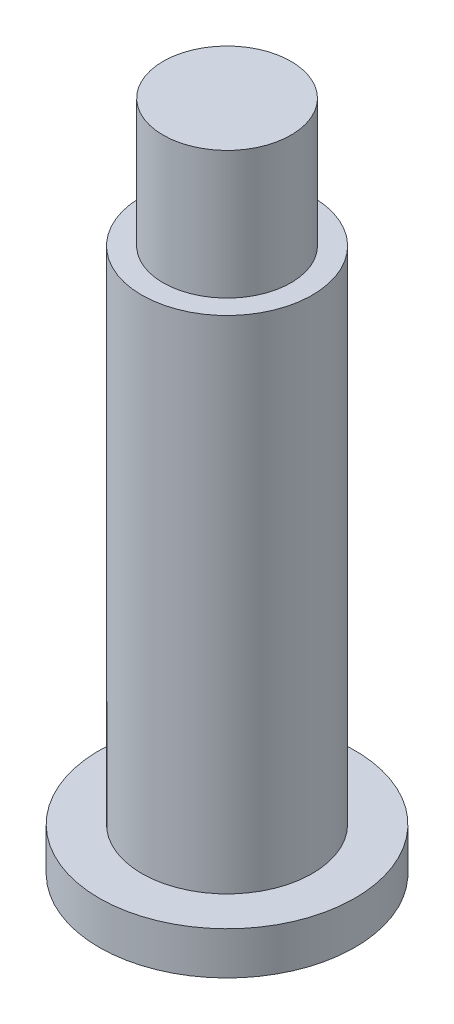
ISO-10303-21;
HEADER;
FILE_DESCRIPTION(('STEP AP214'),'2;1');
FILE_NAME('part.step','',(''),(''),'','','');
FILE_SCHEMA(('AUTOMOTIVE_DESIGN { 1 0 10303 214 1 1 1 1 }'));
ENDSEC;
DATA;
#1=APPLICATION_CONTEXT('core data for automotive mechanical design processes');
#2=APPLICATION_PROTOCOL_DEFINITION('international standard','automotive_design',2000,#1);
#3=PRODUCT_CONTEXT('',#1,'mechanical');
#4=PRODUCT('Part','Part','',(#3));
#5=PRODUCT_RELATED_PRODUCT_CATEGORY('part','',(#4));
#6=PRODUCT_DEFINITION_FORMATION('','',#4);
#7=PRODUCT_DEFINITION_CONTEXT('part definition',#1,'design');
#8=PRODUCT_DEFINITION('design','',#6,#7);
#9=PRODUCT_DEFINITION_SHAPE('','',#8);
#10=(LENGTH_UNIT() NAMED_UNIT(*) SI_UNIT(.MILLI.,.METRE.));
#11=(NAMED_UNIT(*) PLANE_ANGLE_UNIT() SI_UNIT($,.RADIAN.));
#12=(NAMED_UNIT(*) SI_UNIT($,.STERADIAN.) SOLID_ANGLE_UNIT());
#13=UNCERTAINTY_MEASURE_WITH_UNIT(LENGTH_MEASURE(1.E-05),#10,'distance_accuracy_value','');
#14=(GEOMETRIC_REPRESENTATION_CONTEXT(3) GLOBAL_UNCERTAINTY_ASSIGNED_CONTEXT((#13)) GLOBAL_UNIT_ASSIGNED_CONTEXT((#10,
#11,#12)) REPRESENTATION_CONTEXT('',''));
#15=CARTESIAN_POINT('',(0.,0.,0.));
#16=DIRECTION('',(0.,0.,1.));
#17=DIRECTION('',(1.,0.,0.));
#18=AXIS2_PLACEMENT_3D('',#15,#16,#17);
#19=CARTESIAN_POINT('',(0.,25.5,0.));
#20=DIRECTION('',(0.,1.,0.));
#21=DIRECTION('',(0.,0.,1.));
#22=AXIS2_PLACEMENT_3D('',#19,#20,#21);
#23=PLANE('',#22);
#24=CARTESIAN_POINT('',(0.,25.5,0.));
#25=DIRECTION('',(0.,1.,0.));
#26=DIRECTION('',(0.,0.,1.));
#27=AXIS2_PLACEMENT_3D('',#24,#25,#26);
#28=CIRCLE('',#27,4.);
#29=CARTESIAN_POINT('',(0.,25.5,4.));
#30=VERTEX_POINT('',#29);
#31=EDGE_CURVE('E46',#30,#30,#28,.T.);
#32=ORIENTED_EDGE('',*,*,#31,.T.);
#33=EDGE_LOOP('',(#32));
#34=FACE_BOUND('',#33,.T.);
#35=CARTESIAN_POINT('',(0.,25.5,0.));
#36=DIRECTION('',(0.,1.,0.));
#37=DIRECTION('',(0.,0.,1.));
#38=AXIS2_PLACEMENT_3D('',#35,#36,#37);
#39=CIRCLE('',#38,3.);
#40=CARTESIAN_POINT('',(0.,25.5,3.));
#41=VERTEX_POINT('',#40);
#42=EDGE_CURVE('E54',#41,#41,#39,.T.);
#43=ORIENTED_EDGE('',*,*,#42,.F.);
#44=EDGE_LOOP('',(#43));
#45=FACE_BOUND('',#44,.T.);
#46=ADVANCED_FACE('F35',(#34,#45),#23,.T.);
#47=CARTESIAN_POINT('',(0.,2.,0.));
#48=DIRECTION('',(0.,1.,0.));
#49=DIRECTION('',(0.,0.,1.));
#50=AXIS2_PLACEMENT_3D('',#47,#48,#49);
#51=PLANE('',#50);
#52=CARTESIAN_POINT('',(0.,2.,0.));
#53=DIRECTION('',(0.,1.,0.));
#54=DIRECTION('',(0.,0.,1.));
#55=AXIS2_PLACEMENT_3D('',#52,#53,#54);
#56=CIRCLE('',#55,6.);
#57=CARTESIAN_POINT('',(0.,2.,6.));
#58=VERTEX_POINT('',#57);
#59=EDGE_CURVE('E10',#58,#58,#56,.T.);
#60=ORIENTED_EDGE('',*,*,#59,.T.);
#61=EDGE_LOOP('',(#60));
#62=FACE_BOUND('',#61,.T.);
#63=CARTESIAN_POINT('',(0.,2.,0.));
#64=DIRECTION('',(0.,1.,0.));
#65=DIRECTION('',(0.,0.,1.));
#66=AXIS2_PLACEMENT_3D('',#63,#64,#65);
#67=CIRCLE('',#66,4.);
#68=CARTESIAN_POINT('',(0.,2.,4.));
#69=VERTEX_POINT('',#68);
#70=EDGE_CURVE('E48',#69,#69,#67,.T.);
#71=ORIENTED_EDGE('',*,*,#70,.F.);
#72=EDGE_LOOP('',(#71));
#73=FACE_BOUND('',#72,.T.);
#74=ADVANCED_FACE('F70',(#62,#73),#51,.T.);
#75=CARTESIAN_POINT('',(0.,2.,0.));
#76=DIRECTION('',(0.,-1.,0.));
#77=DIRECTION('',(0.,0.,-1.));
#78=AXIS2_PLACEMENT_3D('',#75,#76,#77);
#79=CYLINDRICAL_SURFACE('',#78,6.);
#80=ORIENTED_EDGE('',*,*,#59,.F.);
#81=EDGE_LOOP('',(#80));
#82=FACE_BOUND('',#81,.T.);
#83=CARTESIAN_POINT('',(0.,0.,0.));
#84=DIRECTION('',(0.,1.,0.));
#85=DIRECTION('',(0.,0.,1.));
#86=AXIS2_PLACEMENT_3D('',#83,#84,#85);
#87=CIRCLE('',#86,6.);
#88=CARTESIAN_POINT('',(0.,0.,6.));
#89=VERTEX_POINT('',#88);
#90=EDGE_CURVE('E39',#89,#89,#87,.T.);
#91=ORIENTED_EDGE('',*,*,#90,.T.);
#92=EDGE_LOOP('',(#91));
#93=FACE_BOUND('',#92,.T.);
#94=ADVANCED_FACE('F37',(#82,#93),#79,.T.);
#95=CARTESIAN_POINT('',(0.,0.,0.));
#96=DIRECTION('',(0.,1.,0.));
#97=DIRECTION('',(0.,0.,1.));
#98=AXIS2_PLACEMENT_3D('',#95,#96,#97);
#99=PLANE('',#98);
#100=ORIENTED_EDGE('',*,*,#90,.F.);
#101=EDGE_LOOP('',(#100));
#102=FACE_BOUND('',#101,.T.);
#103=ADVANCED_FACE('F80',(#102),#99,.F.);
#104=CARTESIAN_POINT('',(0.,25.5,0.));
#105=DIRECTION('',(0.,-1.,0.));
#106=DIRECTION('',(0.,0.,-1.));
#107=AXIS2_PLACEMENT_3D('',#104,#105,#106);
#108=CYLINDRICAL_SURFACE('',#107,4.);
#109=ORIENTED_EDGE('',*,*,#31,.F.);
#110=EDGE_LOOP('',(#109));
#111=FACE_BOUND('',#110,.T.);
#112=ORIENTED_EDGE('',*,*,#70,.T.);
#113=EDGE_LOOP('',(#112));
#114=FACE_BOUND('',#113,.T.);
#115=ADVANCED_FACE('F65',(#111,#114),#108,.T.);
#116=CARTESIAN_POINT('',(0.,31.5,0.));
#117=DIRECTION('',(0.,-1.,0.));
#118=DIRECTION('',(0.,0.,-1.));
#119=AXIS2_PLACEMENT_3D('',#116,#117,#118);
#120=CYLINDRICAL_SURFACE('',#119,3.);
#121=CARTESIAN_POINT('',(0.,31.5,0.));
#122=DIRECTION('',(0.,1.,0.));
#123=DIRECTION('',(0.,0.,1.));
#124=AXIS2_PLACEMENT_3D('',#121,#122,#123);
#125=CIRCLE('',#124,3.);
#126=CARTESIAN_POINT('',(0.,31.5,3.));
#127=VERTEX_POINT('',#126);
#128=EDGE_CURVE('E51',#127,#127,#125,.T.);
#129=ORIENTED_EDGE('',*,*,#128,.F.);
#130=EDGE_LOOP('',(#129));
#131=FACE_BOUND('',#130,.T.);
#132=ORIENTED_EDGE('',*,*,#42,.T.);
#133=EDGE_LOOP('',(#132));
#134=FACE_BOUND('',#133,.T.);
#135=ADVANCED_FACE('F62',(#131,#134),#120,.T.);
#136=CARTESIAN_POINT('',(0.,31.5,0.));
#137=DIRECTION('',(0.,1.,0.));
#138=DIRECTION('',(0.,0.,1.));
#139=AXIS2_PLACEMENT_3D('',#136,#137,#138);
#140=PLANE('',#139);
#141=ORIENTED_EDGE('',*,*,#128,.T.);
#142=EDGE_LOOP('',(#141));
#143=FACE_BOUND('',#142,.T.);
#144=ADVANCED_FACE('F60',(#143),#140,.T.);
#145=CLOSED_SHELL('',(#46,#74,#94,#103,#115,#135,#144));
#146=MANIFOLD_SOLID_BREP('B2',#145);
#147=ADVANCED_BREP_SHAPE_REPRESENTATION('',(#18,#146),#14);
#148=SHAPE_DEFINITION_REPRESENTATION(#9,#147);
ENDSEC;
END-ISO-10303-21;
